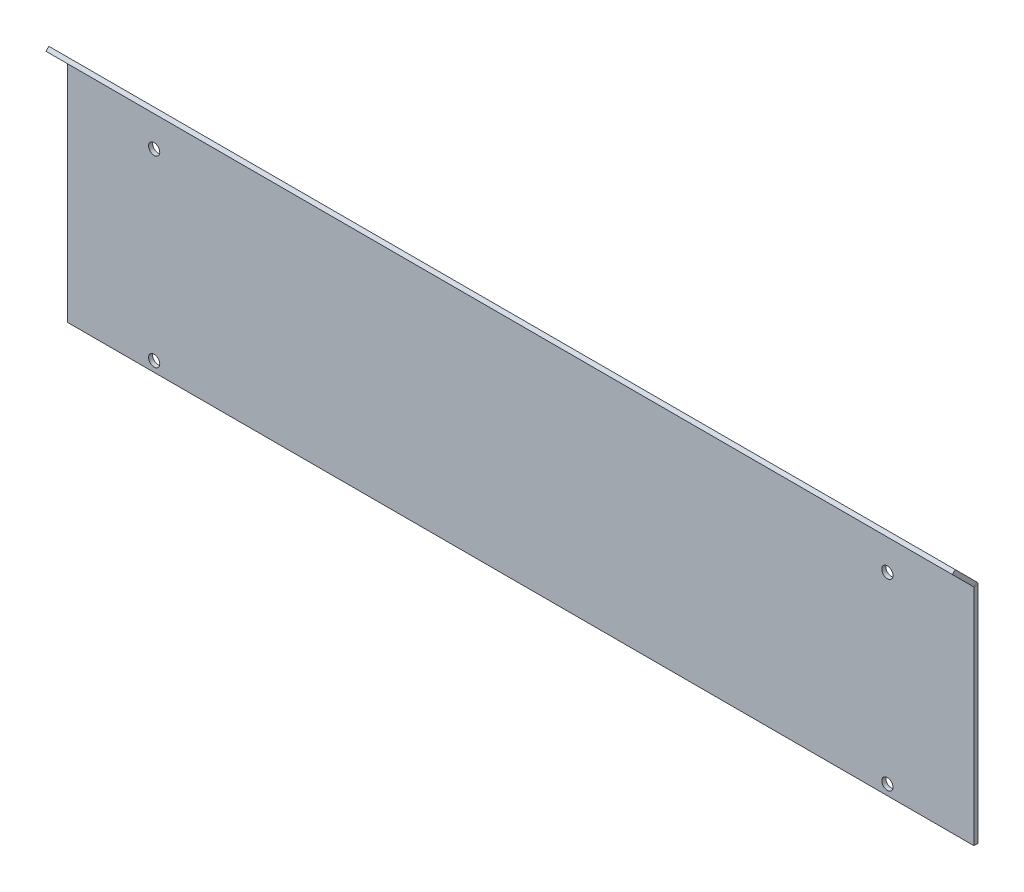
ISO-10303-21;
HEADER;
FILE_DESCRIPTION(('STEP AP214'),'2;1');
FILE_NAME('part.step','',(''),(''),'','','');
FILE_SCHEMA(('AUTOMOTIVE_DESIGN { 1 0 10303 214 1 1 1 1 }'));
ENDSEC;
DATA;
#1=APPLICATION_CONTEXT('core data for automotive mechanical design processes');
#2=APPLICATION_PROTOCOL_DEFINITION('international standard','automotive_design',2000,#1);
#3=PRODUCT_CONTEXT('',#1,'mechanical');
#4=PRODUCT('Part','Part','',(#3));
#5=PRODUCT_RELATED_PRODUCT_CATEGORY('part','',(#4));
#6=PRODUCT_DEFINITION_FORMATION('','',#4);
#7=PRODUCT_DEFINITION_CONTEXT('part definition',#1,'design');
#8=PRODUCT_DEFINITION('design','',#6,#7);
#9=PRODUCT_DEFINITION_SHAPE('','',#8);
#10=(LENGTH_UNIT() NAMED_UNIT(*) SI_UNIT(.MILLI.,.METRE.));
#11=(NAMED_UNIT(*) PLANE_ANGLE_UNIT() SI_UNIT($,.RADIAN.));
#12=(NAMED_UNIT(*) SI_UNIT($,.STERADIAN.) SOLID_ANGLE_UNIT());
#13=UNCERTAINTY_MEASURE_WITH_UNIT(LENGTH_MEASURE(1.E-05),#10,'distance_accuracy_value','');
#14=(GEOMETRIC_REPRESENTATION_CONTEXT(3) GLOBAL_UNCERTAINTY_ASSIGNED_CONTEXT((#13)) GLOBAL_UNIT_ASSIGNED_CONTEXT((#10,
#11,#12)) REPRESENTATION_CONTEXT('',''));
#15=CARTESIAN_POINT('',(0.,0.,0.));
#16=DIRECTION('',(0.,0.,1.));
#17=DIRECTION('',(1.,0.,0.));
#18=AXIS2_PLACEMENT_3D('',#15,#16,#17);
#19=CARTESIAN_POINT('',(0.,0.,-2.));
#20=DIRECTION('',(-1.,0.,0.));
#21=DIRECTION('',(0.,0.,1.));
#22=AXIS2_PLACEMENT_3D('',#19,#20,#21);
#23=PLANE('',#22);
#24=DIRECTION('',(0.,-1.,0.));
#25=VECTOR('',#24,1.);
#26=CARTESIAN_POINT('',(0.,0.,0.));
#27=LINE('',#26,#25);
#28=CARTESIAN_POINT('',(0.,110.,0.));
#29=VERTEX_POINT('',#28);
#30=CARTESIAN_POINT('',(0.,0.,0.));
#31=VERTEX_POINT('',#30);
#32=EDGE_CURVE('E147',#29,#31,#27,.T.);
#33=ORIENTED_EDGE('',*,*,#32,.F.);
#34=DIRECTION('',(0.,0.,1.));
#35=VECTOR('',#34,1.);
#36=CARTESIAN_POINT('',(0.,110.,-2.));
#37=LINE('',#36,#35);
#38=CARTESIAN_POINT('',(0.,110.,-2.));
#39=VERTEX_POINT('',#38);
#40=EDGE_CURVE('E11',#39,#29,#37,.T.);
#41=ORIENTED_EDGE('',*,*,#40,.F.);
#42=DIRECTION('',(0.,-1.,0.));
#43=VECTOR('',#42,1.);
#44=CARTESIAN_POINT('',(0.,0.,-2.));
#45=LINE('',#44,#43);
#46=CARTESIAN_POINT('',(0.,0.,-2.));
#47=VERTEX_POINT('',#46);
#48=EDGE_CURVE('E117',#39,#47,#45,.T.);
#49=ORIENTED_EDGE('',*,*,#48,.T.);
#50=DIRECTION('',(0.,0.,1.));
#51=VECTOR('',#50,1.);
#52=CARTESIAN_POINT('',(0.,0.,-2.));
#53=LINE('',#52,#51);
#54=EDGE_CURVE('E156',#47,#31,#53,.T.);
#55=ORIENTED_EDGE('',*,*,#54,.T.);
#56=EDGE_LOOP('',(#33,#41,#49,#55));
#57=FACE_BOUND('',#56,.T.);
#58=ADVANCED_FACE('F43',(#57),#23,.T.);
#59=CARTESIAN_POINT('',(445.,0.,-2.));
#60=DIRECTION('',(1.,0.,0.));
#61=DIRECTION('',(0.,0.,-1.));
#62=AXIS2_PLACEMENT_3D('',#59,#60,#61);
#63=PLANE('',#62);
#64=DIRECTION('',(0.,1.,0.));
#65=VECTOR('',#64,1.);
#66=CARTESIAN_POINT('',(445.,0.,0.));
#67=LINE('',#66,#65);
#68=CARTESIAN_POINT('',(445.,0.,0.));
#69=VERTEX_POINT('',#68);
#70=CARTESIAN_POINT('',(445.,110.,0.));
#71=VERTEX_POINT('',#70);
#72=EDGE_CURVE('E93',#69,#71,#67,.T.);
#73=ORIENTED_EDGE('',*,*,#72,.F.);
#74=DIRECTION('',(0.,0.,1.));
#75=VECTOR('',#74,1.);
#76=CARTESIAN_POINT('',(445.,0.,-2.));
#77=LINE('',#76,#75);
#78=CARTESIAN_POINT('',(445.,0.,-2.));
#79=VERTEX_POINT('',#78);
#80=EDGE_CURVE('E61',#79,#69,#77,.T.);
#81=ORIENTED_EDGE('',*,*,#80,.F.);
#82=DIRECTION('',(0.,1.,0.));
#83=VECTOR('',#82,1.);
#84=CARTESIAN_POINT('',(445.,0.,-2.));
#85=LINE('',#84,#83);
#86=CARTESIAN_POINT('',(445.,110.,-2.));
#87=VERTEX_POINT('',#86);
#88=EDGE_CURVE('E95',#79,#87,#85,.T.);
#89=ORIENTED_EDGE('',*,*,#88,.T.);
#90=DIRECTION('',(0.,0.,1.));
#91=VECTOR('',#90,1.);
#92=CARTESIAN_POINT('',(445.,110.,-2.));
#93=LINE('',#92,#91);
#94=EDGE_CURVE('E52',#87,#71,#93,.T.);
#95=ORIENTED_EDGE('',*,*,#94,.T.);
#96=EDGE_LOOP('',(#73,#81,#89,#95));
#97=FACE_BOUND('',#96,.T.);
#98=ADVANCED_FACE('F92',(#97),#63,.T.);
#99=CARTESIAN_POINT('',(0.,0.,-2.));
#100=DIRECTION('',(0.,-1.,0.));
#101=DIRECTION('',(0.,0.,-1.));
#102=AXIS2_PLACEMENT_3D('',#99,#100,#101);
#103=PLANE('',#102);
#104=DIRECTION('',(1.,0.,0.));
#105=VECTOR('',#104,1.);
#106=CARTESIAN_POINT('',(0.,0.,0.));
#107=LINE('',#106,#105);
#108=EDGE_CURVE('E106',#31,#69,#107,.T.);
#109=ORIENTED_EDGE('',*,*,#108,.F.);
#110=ORIENTED_EDGE('',*,*,#54,.F.);
#111=DIRECTION('',(1.,0.,0.));
#112=VECTOR('',#111,1.);
#113=CARTESIAN_POINT('',(0.,0.,-2.));
#114=LINE('',#113,#112);
#115=EDGE_CURVE('E150',#47,#79,#114,.T.);
#116=ORIENTED_EDGE('',*,*,#115,.T.);
#117=ORIENTED_EDGE('',*,*,#80,.T.);
#118=EDGE_LOOP('',(#109,#110,#116,#117));
#119=FACE_BOUND('',#118,.T.);
#120=ADVANCED_FACE('F163',(#119),#103,.T.);
#121=CARTESIAN_POINT('',(0.,0.,-2.));
#122=DIRECTION('',(0.,0.,-1.));
#123=DIRECTION('',(-1.,0.,0.));
#124=AXIS2_PLACEMENT_3D('',#121,#122,#123);
#125=PLANE('',#124);
#126=CARTESIAN_POINT('',(42.5,95.,-2.));
#127=DIRECTION('',(0.,0.,-1.));
#128=DIRECTION('',(-1.,0.,0.));
#129=AXIS2_PLACEMENT_3D('',#126,#127,#128);
#130=CIRCLE('',#129,2.75);
#131=CARTESIAN_POINT('',(39.75,95.,-2.));
#132=VERTEX_POINT('',#131);
#133=EDGE_CURVE('E328',#132,#132,#130,.T.);
#134=ORIENTED_EDGE('',*,*,#133,.F.);
#135=EDGE_LOOP('',(#134));
#136=FACE_BOUND('',#135,.T.);
#137=CARTESIAN_POINT('',(42.5,5.,-2.));
#138=DIRECTION('',(0.,0.,-1.));
#139=DIRECTION('',(-1.,0.,0.));
#140=AXIS2_PLACEMENT_3D('',#137,#138,#139);
#141=CIRCLE('',#140,2.75);
#142=CARTESIAN_POINT('',(39.75,5.,-2.));
#143=VERTEX_POINT('',#142);
#144=EDGE_CURVE('E338',#143,#143,#141,.T.);
#145=ORIENTED_EDGE('',*,*,#144,.F.);
#146=EDGE_LOOP('',(#145));
#147=FACE_BOUND('',#146,.T.);
#148=CARTESIAN_POINT('',(402.5,95.,-2.));
#149=DIRECTION('',(0.,0.,-1.));
#150=DIRECTION('',(-1.,0.,0.));
#151=AXIS2_PLACEMENT_3D('',#148,#149,#150);
#152=CIRCLE('',#151,2.74999999999997);
#153=CARTESIAN_POINT('',(399.75,95.,-2.));
#154=VERTEX_POINT('',#153);
#155=EDGE_CURVE('E46',#154,#154,#152,.T.);
#156=ORIENTED_EDGE('',*,*,#155,.F.);
#157=EDGE_LOOP('',(#156));
#158=FACE_BOUND('',#157,.T.);
#159=CARTESIAN_POINT('',(402.5,5.,-2.));
#160=DIRECTION('',(0.,0.,-1.));
#161=DIRECTION('',(-1.,0.,0.));
#162=AXIS2_PLACEMENT_3D('',#159,#160,#161);
#163=CIRCLE('',#162,2.74999999999997);
#164=CARTESIAN_POINT('',(399.75,5.,-2.));
#165=VERTEX_POINT('',#164);
#166=EDGE_CURVE('E123',#165,#165,#163,.T.);
#167=ORIENTED_EDGE('',*,*,#166,.F.);
#168=EDGE_LOOP('',(#167));
#169=FACE_BOUND('',#168,.T.);
#170=ORIENTED_EDGE('',*,*,#48,.F.);
#171=DIRECTION('',(-1.,0.,0.));
#172=VECTOR('',#171,1.);
#173=CARTESIAN_POINT('',(0.,110.,-2.));
#174=LINE('',#173,#172);
#175=EDGE_CURVE('E153',#87,#39,#174,.T.);
#176=ORIENTED_EDGE('',*,*,#175,.F.);
#177=ORIENTED_EDGE('',*,*,#88,.F.);
#178=ORIENTED_EDGE('',*,*,#115,.F.);
#179=EDGE_LOOP('',(#170,#176,#177,#178));
#180=FACE_BOUND('',#179,.T.);
#181=ADVANCED_FACE('F165',(#136,#147,#158,#169,#180),#125,.T.);
#182=CARTESIAN_POINT('',(0.,0.,0.));
#183=DIRECTION('',(0.,0.,-1.));
#184=DIRECTION('',(-1.,0.,0.));
#185=AXIS2_PLACEMENT_3D('',#182,#183,#184);
#186=PLANE('',#185);
#187=CARTESIAN_POINT('',(42.5,95.,0.));
#188=DIRECTION('',(0.,0.,1.));
#189=DIRECTION('',(1.,0.,0.));
#190=AXIS2_PLACEMENT_3D('',#187,#188,#189);
#191=CIRCLE('',#190,2.75);
#192=CARTESIAN_POINT('',(45.25,95.,0.));
#193=VERTEX_POINT('',#192);
#194=EDGE_CURVE('E331',#193,#193,#191,.T.);
#195=ORIENTED_EDGE('',*,*,#194,.F.);
#196=EDGE_LOOP('',(#195));
#197=FACE_BOUND('',#196,.T.);
#198=CARTESIAN_POINT('',(42.5,5.,0.));
#199=DIRECTION('',(0.,0.,1.));
#200=DIRECTION('',(1.,0.,0.));
#201=AXIS2_PLACEMENT_3D('',#198,#199,#200);
#202=CIRCLE('',#201,2.75);
#203=CARTESIAN_POINT('',(45.25,5.,0.));
#204=VERTEX_POINT('',#203);
#205=EDGE_CURVE('E333',#204,#204,#202,.T.);
#206=ORIENTED_EDGE('',*,*,#205,.F.);
#207=EDGE_LOOP('',(#206));
#208=FACE_BOUND('',#207,.T.);
#209=CARTESIAN_POINT('',(402.5,95.,0.));
#210=DIRECTION('',(0.,0.,1.));
#211=DIRECTION('',(1.,0.,0.));
#212=AXIS2_PLACEMENT_3D('',#209,#210,#211);
#213=CIRCLE('',#212,2.74999999999997);
#214=CARTESIAN_POINT('',(405.25,95.,0.));
#215=VERTEX_POINT('',#214);
#216=EDGE_CURVE('E341',#215,#215,#213,.T.);
#217=ORIENTED_EDGE('',*,*,#216,.F.);
#218=EDGE_LOOP('',(#217));
#219=FACE_BOUND('',#218,.T.);
#220=CARTESIAN_POINT('',(402.5,5.,0.));
#221=DIRECTION('',(0.,0.,1.));
#222=DIRECTION('',(1.,0.,0.));
#223=AXIS2_PLACEMENT_3D('',#220,#221,#222);
#224=CIRCLE('',#223,2.74999999999997);
#225=CARTESIAN_POINT('',(405.25,5.,0.));
#226=VERTEX_POINT('',#225);
#227=EDGE_CURVE('E128',#226,#226,#224,.T.);
#228=ORIENTED_EDGE('',*,*,#227,.F.);
#229=EDGE_LOOP('',(#228));
#230=FACE_BOUND('',#229,.T.);
#231=ORIENTED_EDGE('',*,*,#32,.T.);
#232=ORIENTED_EDGE('',*,*,#108,.T.);
#233=ORIENTED_EDGE('',*,*,#72,.T.);
#234=DIRECTION('',(-1.,0.,0.));
#235=VECTOR('',#234,1.);
#236=CARTESIAN_POINT('',(0.,110.,0.));
#237=LINE('',#236,#235);
#238=EDGE_CURVE('E104',#71,#29,#237,.T.);
#239=ORIENTED_EDGE('',*,*,#238,.T.);
#240=EDGE_LOOP('',(#231,#232,#233,#239));
#241=FACE_BOUND('',#240,.T.);
#242=ADVANCED_FACE('F102',(#197,#208,#219,#230,#241),#186,.F.);
#243=CARTESIAN_POINT('',(0.,110.,-2.));
#244=DIRECTION('',(-1.,0.,0.));
#245=DIRECTION('',(0.,0.,1.));
#246=AXIS2_PLACEMENT_3D('',#243,#244,#245);
#247=PLANE('',#246);
#248=CARTESIAN_POINT('',(0.,110.,0.));
#249=DIRECTION('',(1.,0.,0.));
#250=DIRECTION('',(0.,0.,-1.));
#251=AXIS2_PLACEMENT_3D('',#248,#249,#250);
#252=CIRCLE('',#251,2.);
#253=CARTESIAN_POINT('',(0.,111.414213562373,-1.4142135623731));
#254=VERTEX_POINT('',#253);
#255=EDGE_CURVE('E144',#39,#254,#252,.T.);
#256=ORIENTED_EDGE('',*,*,#255,.F.);
#257=ORIENTED_EDGE('',*,*,#40,.T.);
#258=DIRECTION('',(0.,-0.707106781186544,0.707106781186551));
#259=VECTOR('',#258,1.);
#260=CARTESIAN_POINT('',(0.,111.414213562373,-1.4142135623731));
#261=LINE('',#260,#259);
#262=EDGE_CURVE('E89',#254,#29,#261,.T.);
#263=ORIENTED_EDGE('',*,*,#262,.F.);
#264=EDGE_LOOP('',(#256,#257,#263));
#265=FACE_BOUND('',#264,.T.);
#266=ADVANCED_FACE('F187',(#265),#247,.T.);
#267=CARTESIAN_POINT('',(445.,110.,0.));
#268=DIRECTION('',(1.,0.,0.));
#269=DIRECTION('',(0.,0.,-1.));
#270=AXIS2_PLACEMENT_3D('',#267,#268,#269);
#271=CYLINDRICAL_SURFACE('',#270,2.);
#272=CARTESIAN_POINT('',(445.,110.,0.));
#273=DIRECTION('',(1.,0.,0.));
#274=DIRECTION('',(0.,0.,-1.));
#275=AXIS2_PLACEMENT_3D('',#272,#273,#274);
#276=CIRCLE('',#275,2.);
#277=CARTESIAN_POINT('',(445.,111.414213562373,-1.4142135623731));
#278=VERTEX_POINT('',#277);
#279=EDGE_CURVE('E84',#87,#278,#276,.T.);
#280=ORIENTED_EDGE('',*,*,#279,.F.);
#281=ORIENTED_EDGE('',*,*,#175,.T.);
#282=ORIENTED_EDGE('',*,*,#255,.T.);
#283=DIRECTION('',(-1.,0.,0.));
#284=VECTOR('',#283,1.);
#285=CARTESIAN_POINT('',(445.,111.414213562373,-1.4142135623731));
#286=LINE('',#285,#284);
#287=EDGE_CURVE('E348',#278,#254,#286,.T.);
#288=ORIENTED_EDGE('',*,*,#287,.F.);
#289=EDGE_LOOP('',(#280,#281,#282,#288));
#290=FACE_BOUND('',#289,.T.);
#291=ADVANCED_FACE('F192',(#290),#271,.T.);
#292=CARTESIAN_POINT('',(445.,110.,-2.));
#293=DIRECTION('',(-1.,0.,0.));
#294=DIRECTION('',(0.,0.,1.));
#295=AXIS2_PLACEMENT_3D('',#292,#293,#294);
#296=PLANE('',#295);
#297=ORIENTED_EDGE('',*,*,#94,.F.);
#298=ORIENTED_EDGE('',*,*,#279,.T.);
#299=DIRECTION('',(0.,-0.707106781186544,0.707106781186551));
#300=VECTOR('',#299,1.);
#301=CARTESIAN_POINT('',(445.,111.414213562373,-1.4142135623731));
#302=LINE('',#301,#300);
#303=EDGE_CURVE('E79',#278,#71,#302,.T.);
#304=ORIENTED_EDGE('',*,*,#303,.T.);
#305=EDGE_LOOP('',(#297,#298,#304));
#306=FACE_BOUND('',#305,.T.);
#307=ADVANCED_FACE('F81',(#306),#296,.F.);
#308=CARTESIAN_POINT('',(445.,111.414213562373,-1.4142135623731));
#309=DIRECTION('',(-1.,0.,0.));
#310=DIRECTION('',(0.,0.,1.));
#311=AXIS2_PLACEMENT_3D('',#308,#309,#310);
#312=PLANE('',#311);
#313=DIRECTION('',(0.,-0.707106781186551,-0.707106781186544));
#314=VECTOR('',#313,1.);
#315=CARTESIAN_POINT('',(445.,110.,0.));
#316=LINE('',#315,#314);
#317=CARTESIAN_POINT('',(445.,120.606601717798,10.6066017177982));
#318=VERTEX_POINT('',#317);
#319=EDGE_CURVE('E114',#318,#71,#316,.T.);
#320=ORIENTED_EDGE('',*,*,#319,.T.);
#321=ORIENTED_EDGE('',*,*,#303,.F.);
#322=DIRECTION('',(0.,-0.707106781186551,-0.707106781186544));
#323=VECTOR('',#322,1.);
#324=CARTESIAN_POINT('',(445.,111.414213562373,-1.4142135623731));
#325=LINE('',#324,#323);
#326=CARTESIAN_POINT('',(445.,122.020815280171,9.19238815542505));
#327=VERTEX_POINT('',#326);
#328=EDGE_CURVE('E136',#327,#278,#325,.T.);
#329=ORIENTED_EDGE('',*,*,#328,.F.);
#330=DIRECTION('',(0.,-0.707106781186544,0.707106781186551));
#331=VECTOR('',#330,1.);
#332=CARTESIAN_POINT('',(445.,122.020815280171,9.19238815542505));
#333=LINE('',#332,#331);
#334=EDGE_CURVE('E122',#327,#318,#333,.T.);
#335=ORIENTED_EDGE('',*,*,#334,.T.);
#336=EDGE_LOOP('',(#320,#321,#329,#335));
#337=FACE_BOUND('',#336,.T.);
#338=ADVANCED_FACE('F120',(#337),#312,.F.);
#339=CARTESIAN_POINT('',(0.,122.020815280171,9.19238815542505));
#340=DIRECTION('',(1.,0.,0.));
#341=DIRECTION('',(0.,0.,-1.));
#342=AXIS2_PLACEMENT_3D('',#339,#340,#341);
#343=PLANE('',#342);
#344=DIRECTION('',(0.,0.707106781186551,0.707106781186544));
#345=VECTOR('',#344,1.);
#346=CARTESIAN_POINT('',(0.,120.606601717798,10.6066017177982));
#347=LINE('',#346,#345);
#348=CARTESIAN_POINT('',(0.,120.606601717798,10.6066017177982));
#349=VERTEX_POINT('',#348);
#350=EDGE_CURVE('E116',#29,#349,#347,.T.);
#351=ORIENTED_EDGE('',*,*,#350,.T.);
#352=DIRECTION('',(0.,-0.707106781186544,0.707106781186551));
#353=VECTOR('',#352,1.);
#354=CARTESIAN_POINT('',(0.,122.020815280171,9.19238815542505));
#355=LINE('',#354,#353);
#356=CARTESIAN_POINT('',(0.,122.020815280171,9.19238815542505));
#357=VERTEX_POINT('',#356);
#358=EDGE_CURVE('E138',#357,#349,#355,.T.);
#359=ORIENTED_EDGE('',*,*,#358,.F.);
#360=DIRECTION('',(0.,0.707106781186551,0.707106781186544));
#361=VECTOR('',#360,1.);
#362=CARTESIAN_POINT('',(0.,122.020815280171,9.19238815542505));
#363=LINE('',#362,#361);
#364=EDGE_CURVE('E350',#254,#357,#363,.T.);
#365=ORIENTED_EDGE('',*,*,#364,.F.);
#366=ORIENTED_EDGE('',*,*,#262,.T.);
#367=EDGE_LOOP('',(#351,#359,#365,#366));
#368=FACE_BOUND('',#367,.T.);
#369=ADVANCED_FACE('F224',(#368),#343,.F.);
#370=CARTESIAN_POINT('',(445.,122.020815280171,9.19238815542505));
#371=DIRECTION('',(0.,-0.707106781186551,-0.707106781186544));
#372=DIRECTION('',(0.,0.707106781186544,-0.707106781186551));
#373=AXIS2_PLACEMENT_3D('',#370,#371,#372);
#374=PLANE('',#373);
#375=DIRECTION('',(1.,0.,0.));
#376=VECTOR('',#375,1.);
#377=CARTESIAN_POINT('',(445.,120.606601717798,10.6066017177982));
#378=LINE('',#377,#376);
#379=EDGE_CURVE('E125',#349,#318,#378,.T.);
#380=ORIENTED_EDGE('',*,*,#379,.T.);
#381=ORIENTED_EDGE('',*,*,#334,.F.);
#382=DIRECTION('',(1.,0.,0.));
#383=VECTOR('',#382,1.);
#384=CARTESIAN_POINT('',(445.,122.020815280171,9.19238815542505));
#385=LINE('',#384,#383);
#386=EDGE_CURVE('E131',#357,#327,#385,.T.);
#387=ORIENTED_EDGE('',*,*,#386,.F.);
#388=ORIENTED_EDGE('',*,*,#358,.T.);
#389=EDGE_LOOP('',(#380,#381,#387,#388));
#390=FACE_BOUND('',#389,.T.);
#391=ADVANCED_FACE('F234',(#390),#374,.F.);
#392=CARTESIAN_POINT('',(0.,56.4142135623725,-56.4142135623731));
#393=DIRECTION('',(0.,-0.707106781186544,0.707106781186551));
#394=DIRECTION('',(0.,-0.707106781186551,-0.707106781186544));
#395=AXIS2_PLACEMENT_3D('',#392,#393,#394);
#396=PLANE('',#395);
#397=ORIENTED_EDGE('',*,*,#328,.T.);
#398=ORIENTED_EDGE('',*,*,#287,.T.);
#399=ORIENTED_EDGE('',*,*,#364,.T.);
#400=ORIENTED_EDGE('',*,*,#386,.T.);
#401=EDGE_LOOP('',(#397,#398,#399,#400));
#402=FACE_BOUND('',#401,.T.);
#403=ADVANCED_FACE('F245',(#402),#396,.F.);
#404=CARTESIAN_POINT('',(0.,54.9999999999994,-55.));
#405=DIRECTION('',(0.,-0.707106781186544,0.707106781186551));
#406=DIRECTION('',(0.,-0.707106781186551,-0.707106781186544));
#407=AXIS2_PLACEMENT_3D('',#404,#405,#406);
#408=PLANE('',#407);
#409=ORIENTED_EDGE('',*,*,#319,.F.);
#410=ORIENTED_EDGE('',*,*,#379,.F.);
#411=ORIENTED_EDGE('',*,*,#350,.F.);
#412=ORIENTED_EDGE('',*,*,#238,.F.);
#413=EDGE_LOOP('',(#409,#410,#411,#412));
#414=FACE_BOUND('',#413,.T.);
#415=ADVANCED_FACE('F111',(#414),#408,.T.);
#416=CARTESIAN_POINT('',(402.5,5.,0.));
#417=DIRECTION('',(0.,0.,1.));
#418=DIRECTION('',(1.,0.,0.));
#419=AXIS2_PLACEMENT_3D('',#416,#417,#418);
#420=CYLINDRICAL_SURFACE('',#419,2.74999999999997);
#421=ORIENTED_EDGE('',*,*,#166,.T.);
#422=EDGE_LOOP('',(#421));
#423=FACE_BOUND('',#422,.T.);
#424=ORIENTED_EDGE('',*,*,#227,.T.);
#425=EDGE_LOOP('',(#424));
#426=FACE_BOUND('',#425,.T.);
#427=ADVANCED_FACE('F266',(#423,#426),#420,.F.);
#428=CARTESIAN_POINT('',(402.5,95.,0.));
#429=DIRECTION('',(0.,0.,1.));
#430=DIRECTION('',(1.,0.,0.));
#431=AXIS2_PLACEMENT_3D('',#428,#429,#430);
#432=CYLINDRICAL_SURFACE('',#431,2.74999999999997);
#433=ORIENTED_EDGE('',*,*,#155,.T.);
#434=EDGE_LOOP('',(#433));
#435=FACE_BOUND('',#434,.T.);
#436=ORIENTED_EDGE('',*,*,#216,.T.);
#437=EDGE_LOOP('',(#436));
#438=FACE_BOUND('',#437,.T.);
#439=ADVANCED_FACE('F291',(#435,#438),#432,.F.);
#440=CARTESIAN_POINT('',(42.5,5.,0.));
#441=DIRECTION('',(0.,0.,1.));
#442=DIRECTION('',(1.,0.,0.));
#443=AXIS2_PLACEMENT_3D('',#440,#441,#442);
#444=CYLINDRICAL_SURFACE('',#443,2.75);
#445=ORIENTED_EDGE('',*,*,#144,.T.);
#446=EDGE_LOOP('',(#445));
#447=FACE_BOUND('',#446,.T.);
#448=ORIENTED_EDGE('',*,*,#205,.T.);
#449=EDGE_LOOP('',(#448));
#450=FACE_BOUND('',#449,.T.);
#451=ADVANCED_FACE('F301',(#447,#450),#444,.F.);
#452=CARTESIAN_POINT('',(42.5,95.,0.));
#453=DIRECTION('',(0.,0.,1.));
#454=DIRECTION('',(1.,0.,0.));
#455=AXIS2_PLACEMENT_3D('',#452,#453,#454);
#456=CYLINDRICAL_SURFACE('',#455,2.75);
#457=ORIENTED_EDGE('',*,*,#133,.T.);
#458=EDGE_LOOP('',(#457));
#459=FACE_BOUND('',#458,.T.);
#460=ORIENTED_EDGE('',*,*,#194,.T.);
#461=EDGE_LOOP('',(#460));
#462=FACE_BOUND('',#461,.T.);
#463=ADVANCED_FACE('F311',(#459,#462),#456,.F.);
#464=CLOSED_SHELL('',(#58,#98,#120,#181,#242,#266,#291,#307,#338,#369,#391,#403,#415,#427,#439,
#451,#463));
#465=MANIFOLD_SOLID_BREP('B2',#464);
#466=ADVANCED_BREP_SHAPE_REPRESENTATION('',(#18,#465),#14);
#467=SHAPE_DEFINITION_REPRESENTATION(#9,#466);
ENDSEC;
END-ISO-10303-21;
